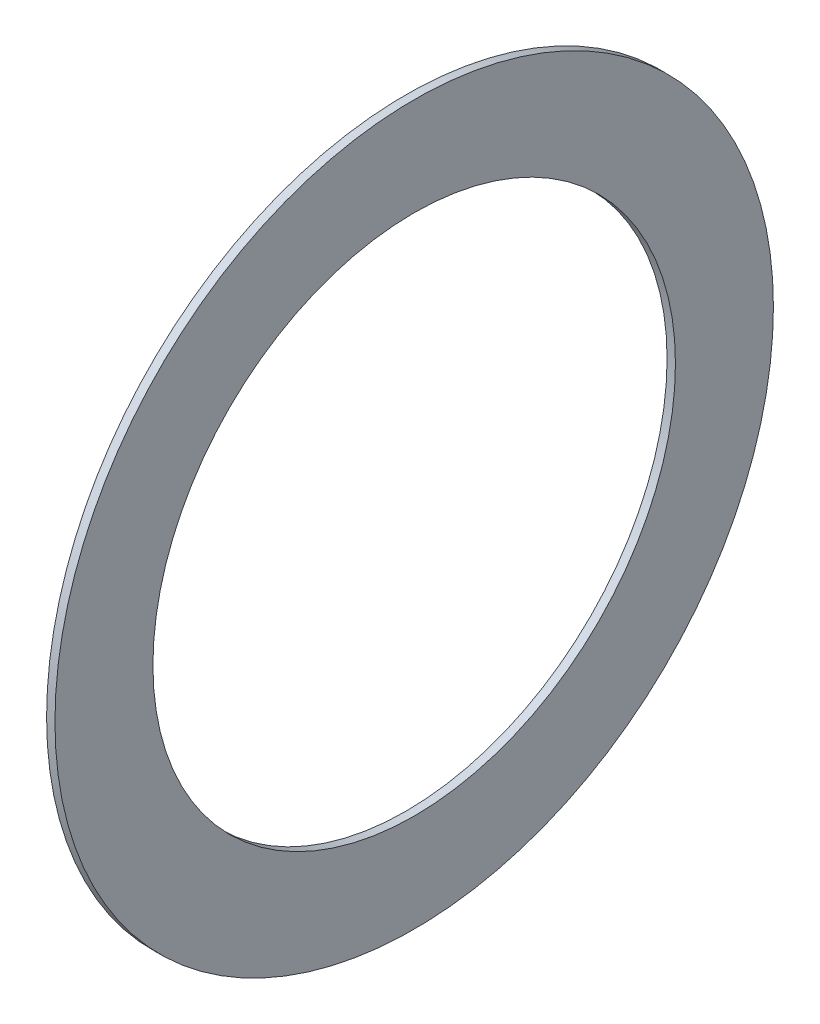
ISO-10303-21;
HEADER;
FILE_DESCRIPTION(('STEP AP214'),'2;1');
FILE_NAME('part.step','',(''),(''),'','','');
FILE_SCHEMA(('AUTOMOTIVE_DESIGN { 1 0 10303 214 1 1 1 1 }'));
ENDSEC;
DATA;
#1=APPLICATION_CONTEXT('core data for automotive mechanical design processes');
#2=APPLICATION_PROTOCOL_DEFINITION('international standard','automotive_design',2000,#1);
#3=PRODUCT_CONTEXT('',#1,'mechanical');
#4=PRODUCT('Part','Part','',(#3));
#5=PRODUCT_RELATED_PRODUCT_CATEGORY('part','',(#4));
#6=PRODUCT_DEFINITION_FORMATION('','',#4);
#7=PRODUCT_DEFINITION_CONTEXT('part definition',#1,'design');
#8=PRODUCT_DEFINITION('design','',#6,#7);
#9=PRODUCT_DEFINITION_SHAPE('','',#8);
#10=(LENGTH_UNIT() NAMED_UNIT(*) SI_UNIT(.MILLI.,.METRE.));
#11=(NAMED_UNIT(*) PLANE_ANGLE_UNIT() SI_UNIT($,.RADIAN.));
#12=(NAMED_UNIT(*) SI_UNIT($,.STERADIAN.) SOLID_ANGLE_UNIT());
#13=UNCERTAINTY_MEASURE_WITH_UNIT(LENGTH_MEASURE(1.E-05),#10,'distance_accuracy_value','');
#14=(GEOMETRIC_REPRESENTATION_CONTEXT(3) GLOBAL_UNCERTAINTY_ASSIGNED_CONTEXT((#13)) GLOBAL_UNIT_ASSIGNED_CONTEXT((#10,
#11,#12)) REPRESENTATION_CONTEXT('',''));
#15=CARTESIAN_POINT('',(0.,0.,0.));
#16=DIRECTION('',(0.,0.,1.));
#17=DIRECTION('',(1.,0.,0.));
#18=AXIS2_PLACEMENT_3D('',#15,#16,#17);
#19=CARTESIAN_POINT('',(0.8128,0.,0.));
#20=DIRECTION('',(1.,0.,0.));
#21=DIRECTION('',(0.,0.,-1.));
#22=AXIS2_PLACEMENT_3D('',#19,#20,#21);
#23=PLANE('',#22);
#24=CARTESIAN_POINT('',(0.8128,0.,0.));
#25=DIRECTION('',(1.,0.,0.));
#26=DIRECTION('',(0.,0.,-1.));
#27=AXIS2_PLACEMENT_3D('',#24,#25,#26);
#28=CIRCLE('',#27,34.925);
#29=CARTESIAN_POINT('',(0.8128,0.,-34.925));
#30=VERTEX_POINT('',#29);
#31=EDGE_CURVE('E10',#30,#30,#28,.T.);
#32=ORIENTED_EDGE('',*,*,#31,.T.);
#33=EDGE_LOOP('',(#32));
#34=FACE_BOUND('',#33,.T.);
#35=CARTESIAN_POINT('',(0.8128,0.,0.));
#36=DIRECTION('',(1.,0.,0.));
#37=DIRECTION('',(0.,0.,-1.));
#38=AXIS2_PLACEMENT_3D('',#35,#36,#37);
#39=CIRCLE('',#38,25.4);
#40=CARTESIAN_POINT('',(0.8128,0.,-25.4));
#41=VERTEX_POINT('',#40);
#42=EDGE_CURVE('E46',#41,#41,#39,.T.);
#43=ORIENTED_EDGE('',*,*,#42,.F.);
#44=EDGE_LOOP('',(#43));
#45=FACE_BOUND('',#44,.T.);
#46=ADVANCED_FACE('F35',(#34,#45),#23,.T.);
#47=CARTESIAN_POINT('',(0.,0.,0.));
#48=DIRECTION('',(1.,0.,0.));
#49=DIRECTION('',(0.,0.,-1.));
#50=AXIS2_PLACEMENT_3D('',#47,#48,#49);
#51=PLANE('',#50);
#52=CARTESIAN_POINT('',(0.,0.,0.));
#53=DIRECTION('',(1.,0.,0.));
#54=DIRECTION('',(0.,0.,-1.));
#55=AXIS2_PLACEMENT_3D('',#52,#53,#54);
#56=CIRCLE('',#55,34.925);
#57=CARTESIAN_POINT('',(0.,0.,-34.925));
#58=VERTEX_POINT('',#57);
#59=EDGE_CURVE('E42',#58,#58,#56,.T.);
#60=ORIENTED_EDGE('',*,*,#59,.F.);
#61=EDGE_LOOP('',(#60));
#62=FACE_BOUND('',#61,.T.);
#63=CARTESIAN_POINT('',(0.,0.,0.));
#64=DIRECTION('',(1.,0.,0.));
#65=DIRECTION('',(0.,0.,-1.));
#66=AXIS2_PLACEMENT_3D('',#63,#64,#65);
#67=CIRCLE('',#66,25.4);
#68=CARTESIAN_POINT('',(0.,0.,-25.4));
#69=VERTEX_POINT('',#68);
#70=EDGE_CURVE('E50',#69,#69,#67,.T.);
#71=ORIENTED_EDGE('',*,*,#70,.T.);
#72=EDGE_LOOP('',(#71));
#73=FACE_BOUND('',#72,.T.);
#74=ADVANCED_FACE('F56',(#62,#73),#51,.F.);
#75=CARTESIAN_POINT('',(0.8128,0.,0.));
#76=DIRECTION('',(-1.,0.,0.));
#77=DIRECTION('',(0.,0.,1.));
#78=AXIS2_PLACEMENT_3D('',#75,#76,#77);
#79=CYLINDRICAL_SURFACE('',#78,34.925);
#80=ORIENTED_EDGE('',*,*,#31,.F.);
#81=EDGE_LOOP('',(#80));
#82=FACE_BOUND('',#81,.T.);
#83=ORIENTED_EDGE('',*,*,#59,.T.);
#84=EDGE_LOOP('',(#83));
#85=FACE_BOUND('',#84,.T.);
#86=ADVANCED_FACE('F37',(#82,#85),#79,.T.);
#87=CARTESIAN_POINT('',(0.8128,0.,0.));
#88=DIRECTION('',(-1.,0.,0.));
#89=DIRECTION('',(0.,0.,1.));
#90=AXIS2_PLACEMENT_3D('',#87,#88,#89);
#91=CYLINDRICAL_SURFACE('',#90,25.4);
#92=ORIENTED_EDGE('',*,*,#42,.T.);
#93=EDGE_LOOP('',(#92));
#94=FACE_BOUND('',#93,.T.);
#95=ORIENTED_EDGE('',*,*,#70,.F.);
#96=EDGE_LOOP('',(#95));
#97=FACE_BOUND('',#96,.T.);
#98=ADVANCED_FACE('F58',(#94,#97),#91,.F.);
#99=CLOSED_SHELL('',(#46,#74,#86,#98));
#100=MANIFOLD_SOLID_BREP('B2',#99);
#101=ADVANCED_BREP_SHAPE_REPRESENTATION('',(#18,#100),#14);
#102=SHAPE_DEFINITION_REPRESENTATION(#9,#101);
ENDSEC;
END-ISO-10303-21;
